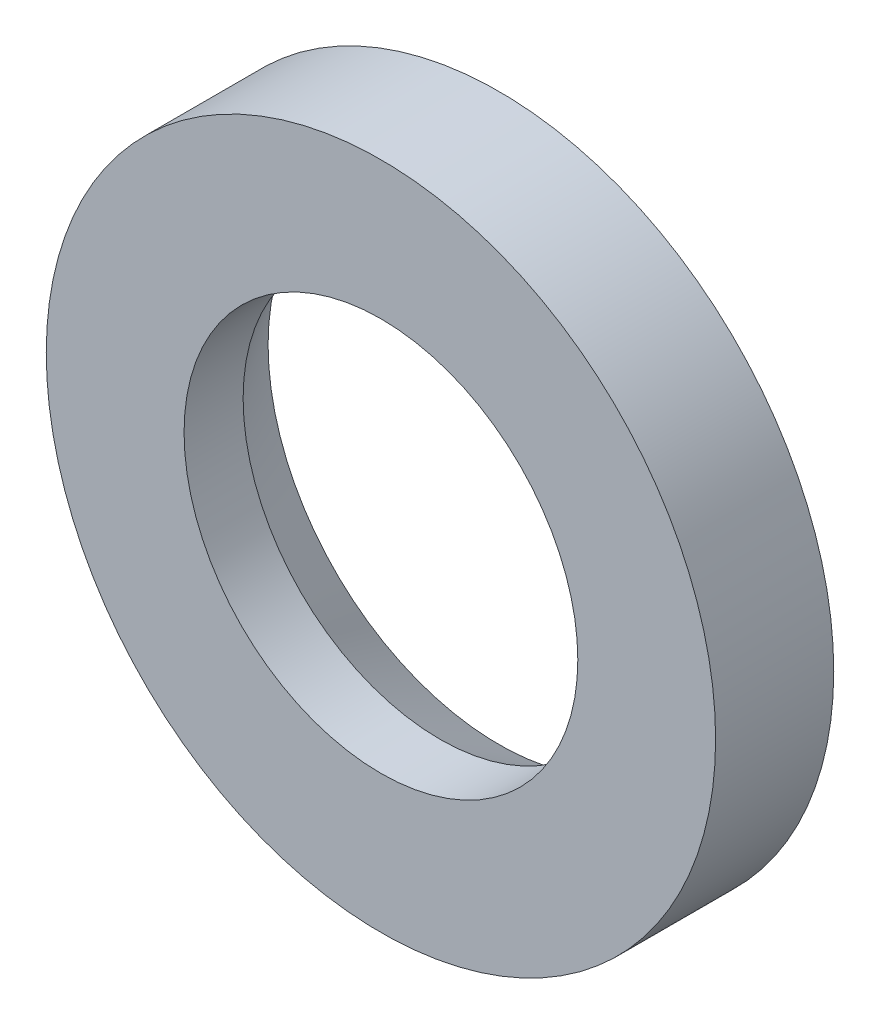
ISO-10303-21;
HEADER;
FILE_DESCRIPTION(('STEP AP214'),'2;1');
FILE_NAME('part.step','',(''),(''),'','','');
FILE_SCHEMA(('AUTOMOTIVE_DESIGN { 1 0 10303 214 1 1 1 1 }'));
ENDSEC;
DATA;
#1=APPLICATION_CONTEXT('core data for automotive mechanical design processes');
#2=APPLICATION_PROTOCOL_DEFINITION('international standard','automotive_design',2000,#1);
#3=PRODUCT_CONTEXT('',#1,'mechanical');
#4=PRODUCT('Part','Part','',(#3));
#5=PRODUCT_RELATED_PRODUCT_CATEGORY('part','',(#4));
#6=PRODUCT_DEFINITION_FORMATION('','',#4);
#7=PRODUCT_DEFINITION_CONTEXT('part definition',#1,'design');
#8=PRODUCT_DEFINITION('design','',#6,#7);
#9=PRODUCT_DEFINITION_SHAPE('','',#8);
#10=(LENGTH_UNIT() NAMED_UNIT(*) SI_UNIT(.MILLI.,.METRE.));
#11=(NAMED_UNIT(*) PLANE_ANGLE_UNIT() SI_UNIT($,.RADIAN.));
#12=(NAMED_UNIT(*) SI_UNIT($,.STERADIAN.) SOLID_ANGLE_UNIT());
#13=UNCERTAINTY_MEASURE_WITH_UNIT(LENGTH_MEASURE(1.E-05),#10,'distance_accuracy_value','');
#14=(GEOMETRIC_REPRESENTATION_CONTEXT(3) GLOBAL_UNCERTAINTY_ASSIGNED_CONTEXT((#13)) GLOBAL_UNIT_ASSIGNED_CONTEXT((#10,
#11,#12)) REPRESENTATION_CONTEXT('',''));
#15=CARTESIAN_POINT('',(0.,0.,0.));
#16=DIRECTION('',(0.,0.,1.));
#17=DIRECTION('',(1.,0.,0.));
#18=AXIS2_PLACEMENT_3D('',#15,#16,#17);
#19=CARTESIAN_POINT('',(0.,0.,-0.6));
#20=DIRECTION('',(0.,0.,1.));
#21=DIRECTION('',(1.,0.,0.));
#22=AXIS2_PLACEMENT_3D('',#19,#20,#21);
#23=CYLINDRICAL_SURFACE('',#22,1.7);
#24=CARTESIAN_POINT('',(0.,0.,-0.6));
#25=DIRECTION('',(0.,0.,1.));
#26=DIRECTION('',(1.,0.,0.));
#27=AXIS2_PLACEMENT_3D('',#24,#25,#26);
#28=CIRCLE('',#27,1.7);
#29=CARTESIAN_POINT('',(1.7,0.,-0.6));
#30=VERTEX_POINT('',#29);
#31=EDGE_CURVE('E45',#30,#30,#28,.T.);
#32=ORIENTED_EDGE('',*,*,#31,.T.);
#33=EDGE_LOOP('',(#32));
#34=FACE_BOUND('',#33,.T.);
#35=CARTESIAN_POINT('',(0.,0.,0.));
#36=DIRECTION('',(0.,0.,1.));
#37=DIRECTION('',(1.,0.,0.));
#38=AXIS2_PLACEMENT_3D('',#35,#36,#37);
#39=CIRCLE('',#38,1.7);
#40=CARTESIAN_POINT('',(1.7,0.,0.));
#41=VERTEX_POINT('',#40);
#42=EDGE_CURVE('E49',#41,#41,#39,.T.);
#43=ORIENTED_EDGE('',*,*,#42,.F.);
#44=EDGE_LOOP('',(#43));
#45=FACE_BOUND('',#44,.T.);
#46=ADVANCED_FACE('F34',(#34,#45),#23,.T.);
#47=CARTESIAN_POINT('',(0.,0.,-0.6));
#48=DIRECTION('',(0.,0.,1.));
#49=DIRECTION('',(1.,0.,0.));
#50=AXIS2_PLACEMENT_3D('',#47,#48,#49);
#51=PLANE('',#50);
#52=CARTESIAN_POINT('',(0.,0.,-0.6));
#53=DIRECTION('',(0.,0.,1.));
#54=DIRECTION('',(1.,0.,0.));
#55=AXIS2_PLACEMENT_3D('',#52,#53,#54);
#56=CIRCLE('',#55,1.17320508075689);
#57=CARTESIAN_POINT('',(1.17320508075689,0.,-0.6));
#58=VERTEX_POINT('',#57);
#59=EDGE_CURVE('E41',#58,#58,#56,.T.);
#60=ORIENTED_EDGE('',*,*,#59,.T.);
#61=EDGE_LOOP('',(#60));
#62=FACE_BOUND('',#61,.T.);
#63=ORIENTED_EDGE('',*,*,#31,.F.);
#64=EDGE_LOOP('',(#63));
#65=FACE_BOUND('',#64,.T.);
#66=ADVANCED_FACE('F63',(#62,#65),#51,.F.);
#67=CARTESIAN_POINT('',(0.,0.,0.));
#68=DIRECTION('',(0.,0.,1.));
#69=DIRECTION('',(1.,0.,0.));
#70=AXIS2_PLACEMENT_3D('',#67,#68,#69);
#71=PLANE('',#70);
#72=CARTESIAN_POINT('',(0.,0.,0.));
#73=DIRECTION('',(0.,0.,1.));
#74=DIRECTION('',(1.,0.,0.));
#75=AXIS2_PLACEMENT_3D('',#72,#73,#74);
#76=CIRCLE('',#75,1.);
#77=CARTESIAN_POINT('',(1.,0.,0.));
#78=VERTEX_POINT('',#77);
#79=EDGE_CURVE('E53',#78,#78,#76,.T.);
#80=ORIENTED_EDGE('',*,*,#79,.F.);
#81=EDGE_LOOP('',(#80));
#82=FACE_BOUND('',#81,.T.);
#83=ORIENTED_EDGE('',*,*,#42,.T.);
#84=EDGE_LOOP('',(#83));
#85=FACE_BOUND('',#84,.T.);
#86=ADVANCED_FACE('F60',(#82,#85),#71,.T.);
#87=CARTESIAN_POINT('',(0.,0.,-0.6));
#88=DIRECTION('',(0.,0.,1.));
#89=DIRECTION('',(1.,0.,0.));
#90=AXIS2_PLACEMENT_3D('',#87,#88,#89);
#91=CYLINDRICAL_SURFACE('',#90,1.);
#92=CARTESIAN_POINT('',(0.,0.,-0.299999999999998));
#93=DIRECTION('',(0.,0.,1.));
#94=DIRECTION('',(1.,0.,0.));
#95=AXIS2_PLACEMENT_3D('',#92,#93,#94);
#96=CIRCLE('',#95,1.);
#97=CARTESIAN_POINT('',(1.,0.,-0.299999999999998));
#98=VERTEX_POINT('',#97);
#99=EDGE_CURVE('E10',#98,#98,#96,.F.);
#100=ORIENTED_EDGE('',*,*,#99,.T.);
#101=EDGE_LOOP('',(#100));
#102=FACE_BOUND('',#101,.T.);
#103=ORIENTED_EDGE('',*,*,#79,.T.);
#104=EDGE_LOOP('',(#103));
#105=FACE_BOUND('',#104,.T.);
#106=ADVANCED_FACE('F58',(#102,#105),#91,.F.);
#107=CARTESIAN_POINT('',(0.,0.,-0.6));
#108=DIRECTION('',(0.,0.,-1.));
#109=DIRECTION('',(-1.,0.,0.));
#110=AXIS2_PLACEMENT_3D('',#107,#108,#109);
#111=CONICAL_SURFACE('',#110,1.17320508075689,0.523598775598296);
#112=ORIENTED_EDGE('',*,*,#99,.F.);
#113=EDGE_LOOP('',(#112));
#114=FACE_BOUND('',#113,.T.);
#115=ORIENTED_EDGE('',*,*,#59,.F.);
#116=EDGE_LOOP('',(#115));
#117=FACE_BOUND('',#116,.T.);
#118=ADVANCED_FACE('F36',(#114,#117),#111,.F.);
#119=CLOSED_SHELL('',(#46,#66,#86,#106,#118));
#120=MANIFOLD_SOLID_BREP('B2',#119);
#121=ADVANCED_BREP_SHAPE_REPRESENTATION('',(#18,#120),#14);
#122=SHAPE_DEFINITION_REPRESENTATION(#9,#121);
ENDSEC;
END-ISO-10303-21;
